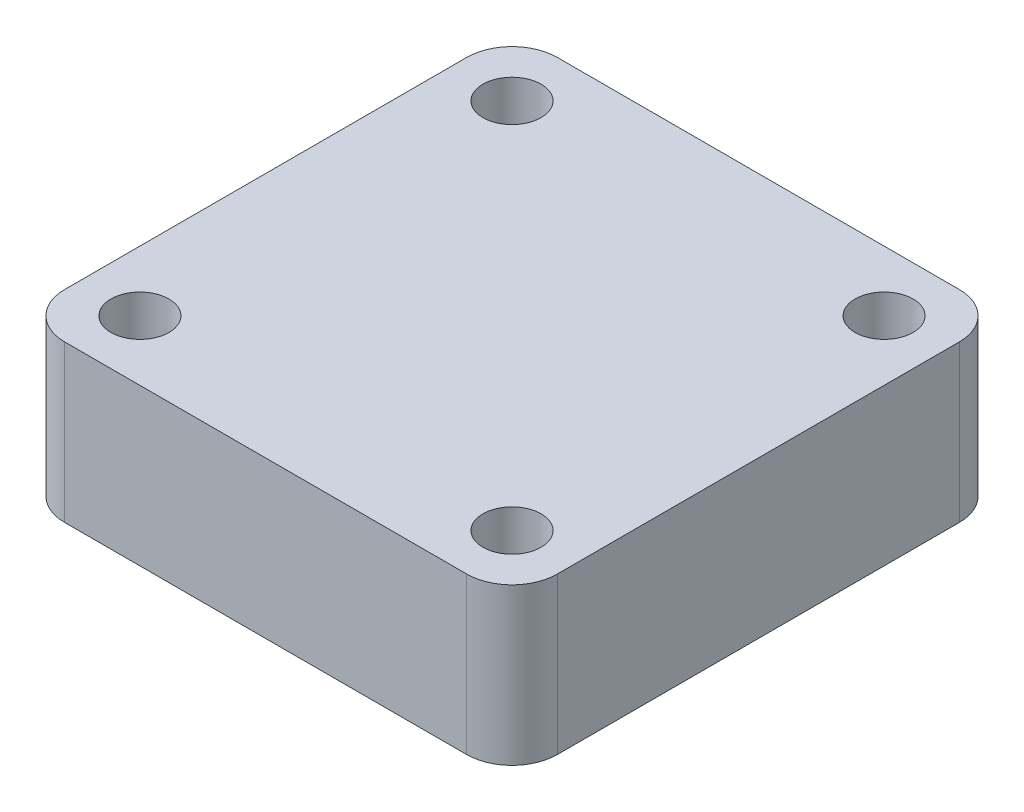
ISO-10303-21;
HEADER;
FILE_DESCRIPTION(('STEP AP214'),'2;1');
FILE_NAME('part.step','',(''),(''),'','','');
FILE_SCHEMA(('AUTOMOTIVE_DESIGN { 1 0 10303 214 1 1 1 1 }'));
ENDSEC;
DATA;
#1=APPLICATION_CONTEXT('core data for automotive mechanical design processes');
#2=APPLICATION_PROTOCOL_DEFINITION('international standard','automotive_design',2000,#1);
#3=PRODUCT_CONTEXT('',#1,'mechanical');
#4=PRODUCT('Part','Part','',(#3));
#5=PRODUCT_RELATED_PRODUCT_CATEGORY('part','',(#4));
#6=PRODUCT_DEFINITION_FORMATION('','',#4);
#7=PRODUCT_DEFINITION_CONTEXT('part definition',#1,'design');
#8=PRODUCT_DEFINITION('design','',#6,#7);
#9=PRODUCT_DEFINITION_SHAPE('','',#8);
#10=(LENGTH_UNIT() NAMED_UNIT(*) SI_UNIT(.MILLI.,.METRE.));
#11=(NAMED_UNIT(*) PLANE_ANGLE_UNIT() SI_UNIT($,.RADIAN.));
#12=(NAMED_UNIT(*) SI_UNIT($,.STERADIAN.) SOLID_ANGLE_UNIT());
#13=UNCERTAINTY_MEASURE_WITH_UNIT(LENGTH_MEASURE(1.E-05),#10,'distance_accuracy_value','');
#14=(GEOMETRIC_REPRESENTATION_CONTEXT(3) GLOBAL_UNCERTAINTY_ASSIGNED_CONTEXT((#13)) GLOBAL_UNIT_ASSIGNED_CONTEXT((#10,
#11,#12)) REPRESENTATION_CONTEXT('',''));
#15=CARTESIAN_POINT('',(0.,0.,0.));
#16=DIRECTION('',(0.,0.,1.));
#17=DIRECTION('',(1.,0.,0.));
#18=AXIS2_PLACEMENT_3D('',#15,#16,#17);
#19=CARTESIAN_POINT('',(27.57,17.5,27.57));
#20=DIRECTION('',(-1.,0.,0.));
#21=DIRECTION('',(0.,0.,1.));
#22=AXIS2_PLACEMENT_3D('',#19,#20,#21);
#23=PLANE('',#22);
#24=DIRECTION('',(0.,0.,-1.));
#25=VECTOR('',#24,1.);
#26=CARTESIAN_POINT('',(27.57,17.5,27.57));
#27=LINE('',#26,#25);
#28=CARTESIAN_POINT('',(27.57,17.5,22.49));
#29=VERTEX_POINT('',#28);
#30=CARTESIAN_POINT('',(27.57,17.5,-22.49));
#31=VERTEX_POINT('',#30);
#32=EDGE_CURVE('E126',#29,#31,#27,.T.);
#33=ORIENTED_EDGE('',*,*,#32,.F.);
#34=DIRECTION('',(0.,-1.,0.));
#35=VECTOR('',#34,1.);
#36=CARTESIAN_POINT('',(27.57,17.5,22.49));
#37=LINE('',#36,#35);
#38=CARTESIAN_POINT('',(27.57,0.,22.49));
#39=VERTEX_POINT('',#38);
#40=EDGE_CURVE('E11',#29,#39,#37,.T.);
#41=ORIENTED_EDGE('',*,*,#40,.T.);
#42=DIRECTION('',(0.,0.,-1.));
#43=VECTOR('',#42,1.);
#44=CARTESIAN_POINT('',(27.57,0.,27.57));
#45=LINE('',#44,#43);
#46=CARTESIAN_POINT('',(27.57,0.,-22.49));
#47=VERTEX_POINT('',#46);
#48=EDGE_CURVE('E128',#39,#47,#45,.T.);
#49=ORIENTED_EDGE('',*,*,#48,.T.);
#50=DIRECTION('',(0.,-1.,0.));
#51=VECTOR('',#50,1.);
#52=CARTESIAN_POINT('',(27.57,17.5,-22.49));
#53=LINE('',#52,#51);
#54=EDGE_CURVE('E145',#47,#31,#53,.F.);
#55=ORIENTED_EDGE('',*,*,#54,.T.);
#56=EDGE_LOOP('',(#33,#41,#49,#55));
#57=FACE_BOUND('',#56,.T.);
#58=ADVANCED_FACE('F34',(#57),#23,.F.);
#59=CARTESIAN_POINT('',(-27.57,17.5,-27.57));
#60=DIRECTION('',(0.,0.,1.));
#61=DIRECTION('',(1.,0.,0.));
#62=AXIS2_PLACEMENT_3D('',#59,#60,#61);
#63=PLANE('',#62);
#64=DIRECTION('',(-1.,0.,0.));
#65=VECTOR('',#64,1.);
#66=CARTESIAN_POINT('',(-27.57,17.5,-27.57));
#67=LINE('',#66,#65);
#68=CARTESIAN_POINT('',(22.49,17.5,-27.57));
#69=VERTEX_POINT('',#68);
#70=CARTESIAN_POINT('',(-22.49,17.5,-27.57));
#71=VERTEX_POINT('',#70);
#72=EDGE_CURVE('E209',#69,#71,#67,.T.);
#73=ORIENTED_EDGE('',*,*,#72,.F.);
#74=DIRECTION('',(0.,-1.,0.));
#75=VECTOR('',#74,1.);
#76=CARTESIAN_POINT('',(22.49,17.5,-27.57));
#77=LINE('',#76,#75);
#78=CARTESIAN_POINT('',(22.49,0.,-27.57));
#79=VERTEX_POINT('',#78);
#80=EDGE_CURVE('E139',#69,#79,#77,.T.);
#81=ORIENTED_EDGE('',*,*,#80,.T.);
#82=DIRECTION('',(-1.,0.,0.));
#83=VECTOR('',#82,1.);
#84=CARTESIAN_POINT('',(-27.57,0.,-27.57));
#85=LINE('',#84,#83);
#86=CARTESIAN_POINT('',(-22.49,0.,-27.57));
#87=VERTEX_POINT('',#86);
#88=EDGE_CURVE('E123',#79,#87,#85,.T.);
#89=ORIENTED_EDGE('',*,*,#88,.T.);
#90=DIRECTION('',(0.,-1.,0.));
#91=VECTOR('',#90,1.);
#92=CARTESIAN_POINT('',(-22.49,17.5,-27.57));
#93=LINE('',#92,#91);
#94=EDGE_CURVE('E109',#87,#71,#93,.F.);
#95=ORIENTED_EDGE('',*,*,#94,.T.);
#96=EDGE_LOOP('',(#73,#81,#89,#95));
#97=FACE_BOUND('',#96,.T.);
#98=ADVANCED_FACE('F181',(#97),#63,.F.);
#99=CARTESIAN_POINT('',(-27.57,17.5,27.57));
#100=DIRECTION('',(1.,0.,0.));
#101=DIRECTION('',(0.,0.,-1.));
#102=AXIS2_PLACEMENT_3D('',#99,#100,#101);
#103=PLANE('',#102);
#104=DIRECTION('',(0.,0.,1.));
#105=VECTOR('',#104,1.);
#106=CARTESIAN_POINT('',(-27.57,0.,27.57));
#107=LINE('',#106,#105);
#108=CARTESIAN_POINT('',(-27.57,0.,-22.49));
#109=VERTEX_POINT('',#108);
#110=CARTESIAN_POINT('',(-27.57,0.,22.49));
#111=VERTEX_POINT('',#110);
#112=EDGE_CURVE('E115',#109,#111,#107,.T.);
#113=ORIENTED_EDGE('',*,*,#112,.T.);
#114=DIRECTION('',(0.,-1.,0.));
#115=VECTOR('',#114,1.);
#116=CARTESIAN_POINT('',(-27.57,17.5,22.49));
#117=LINE('',#116,#115);
#118=CARTESIAN_POINT('',(-27.57,17.5,22.49));
#119=VERTEX_POINT('',#118);
#120=EDGE_CURVE('E57',#111,#119,#117,.F.);
#121=ORIENTED_EDGE('',*,*,#120,.T.);
#122=DIRECTION('',(0.,0.,1.));
#123=VECTOR('',#122,1.);
#124=CARTESIAN_POINT('',(-27.57,17.5,27.57));
#125=LINE('',#124,#123);
#126=CARTESIAN_POINT('',(-27.57,17.5,-22.49));
#127=VERTEX_POINT('',#126);
#128=EDGE_CURVE('E116',#127,#119,#125,.T.);
#129=ORIENTED_EDGE('',*,*,#128,.F.);
#130=DIRECTION('',(0.,-1.,0.));
#131=VECTOR('',#130,1.);
#132=CARTESIAN_POINT('',(-27.57,17.5,-22.49));
#133=LINE('',#132,#131);
#134=EDGE_CURVE('E107',#127,#109,#133,.T.);
#135=ORIENTED_EDGE('',*,*,#134,.T.);
#136=EDGE_LOOP('',(#113,#121,#129,#135));
#137=FACE_BOUND('',#136,.T.);
#138=ADVANCED_FACE('F114',(#137),#103,.F.);
#139=CARTESIAN_POINT('',(-27.57,17.5,27.57));
#140=DIRECTION('',(0.,0.,-1.));
#141=DIRECTION('',(-1.,0.,0.));
#142=AXIS2_PLACEMENT_3D('',#139,#140,#141);
#143=PLANE('',#142);
#144=DIRECTION('',(1.,0.,0.));
#145=VECTOR('',#144,1.);
#146=CARTESIAN_POINT('',(-27.57,17.5,27.57));
#147=LINE('',#146,#145);
#148=CARTESIAN_POINT('',(-22.49,17.5,27.57));
#149=VERTEX_POINT('',#148);
#150=CARTESIAN_POINT('',(22.49,17.5,27.57));
#151=VERTEX_POINT('',#150);
#152=EDGE_CURVE('E117',#149,#151,#147,.T.);
#153=ORIENTED_EDGE('',*,*,#152,.F.);
#154=DIRECTION('',(0.,-1.,0.));
#155=VECTOR('',#154,1.);
#156=CARTESIAN_POINT('',(-22.49,17.5,27.57));
#157=LINE('',#156,#155);
#158=CARTESIAN_POINT('',(-22.49,0.,27.57));
#159=VERTEX_POINT('',#158);
#160=EDGE_CURVE('E152',#149,#159,#157,.T.);
#161=ORIENTED_EDGE('',*,*,#160,.T.);
#162=DIRECTION('',(1.,0.,0.));
#163=VECTOR('',#162,1.);
#164=CARTESIAN_POINT('',(-27.57,0.,27.57));
#165=LINE('',#164,#163);
#166=CARTESIAN_POINT('',(22.49,0.,27.57));
#167=VERTEX_POINT('',#166);
#168=EDGE_CURVE('E122',#159,#167,#165,.T.);
#169=ORIENTED_EDGE('',*,*,#168,.T.);
#170=DIRECTION('',(0.,-1.,0.));
#171=VECTOR('',#170,1.);
#172=CARTESIAN_POINT('',(22.49,17.5,27.57));
#173=LINE('',#172,#171);
#174=EDGE_CURVE('E150',#167,#151,#173,.F.);
#175=ORIENTED_EDGE('',*,*,#174,.T.);
#176=EDGE_LOOP('',(#153,#161,#169,#175));
#177=FACE_BOUND('',#176,.T.);
#178=ADVANCED_FACE('F165',(#177),#143,.F.);
#179=CARTESIAN_POINT('',(0.,17.5,0.));
#180=DIRECTION('',(0.,-1.,0.));
#181=DIRECTION('',(0.,0.,-1.));
#182=AXIS2_PLACEMENT_3D('',#179,#180,#181);
#183=PLANE('',#182);
#184=CARTESIAN_POINT('',(20.82,17.5,20.82));
#185=DIRECTION('',(0.,1.,0.));
#186=DIRECTION('',(0.,0.,1.));
#187=AXIS2_PLACEMENT_3D('',#184,#185,#186);
#188=CIRCLE('',#187,3.25);
#189=CARTESIAN_POINT('',(20.82,17.5,24.07));
#190=VERTEX_POINT('',#189);
#191=EDGE_CURVE('E231',#190,#190,#188,.T.);
#192=ORIENTED_EDGE('',*,*,#191,.F.);
#193=EDGE_LOOP('',(#192));
#194=FACE_BOUND('',#193,.T.);
#195=CARTESIAN_POINT('',(-20.82,17.5,20.82));
#196=DIRECTION('',(0.,-1.,0.));
#197=DIRECTION('',(0.,0.,-1.));
#198=AXIS2_PLACEMENT_3D('',#195,#196,#197);
#199=CIRCLE('',#198,3.25);
#200=CARTESIAN_POINT('',(-20.82,17.5,17.57));
#201=VERTEX_POINT('',#200);
#202=EDGE_CURVE('E224',#201,#201,#199,.T.);
#203=ORIENTED_EDGE('',*,*,#202,.T.);
#204=EDGE_LOOP('',(#203));
#205=FACE_BOUND('',#204,.T.);
#206=CARTESIAN_POINT('',(20.82,17.5,-20.82));
#207=DIRECTION('',(0.,-1.,0.));
#208=DIRECTION('',(0.,0.,-1.));
#209=AXIS2_PLACEMENT_3D('',#206,#207,#208);
#210=CIRCLE('',#209,3.25);
#211=CARTESIAN_POINT('',(20.82,17.5,-24.07));
#212=VERTEX_POINT('',#211);
#213=EDGE_CURVE('E218',#212,#212,#210,.T.);
#214=ORIENTED_EDGE('',*,*,#213,.T.);
#215=EDGE_LOOP('',(#214));
#216=FACE_BOUND('',#215,.T.);
#217=CARTESIAN_POINT('',(-20.82,17.5,-20.82));
#218=DIRECTION('',(0.,1.,0.));
#219=DIRECTION('',(0.,0.,1.));
#220=AXIS2_PLACEMENT_3D('',#217,#218,#219);
#221=CIRCLE('',#220,3.25);
#222=CARTESIAN_POINT('',(-20.82,17.5,-17.57));
#223=VERTEX_POINT('',#222);
#224=EDGE_CURVE('E134',#223,#223,#221,.T.);
#225=ORIENTED_EDGE('',*,*,#224,.F.);
#226=EDGE_LOOP('',(#225));
#227=FACE_BOUND('',#226,.T.);
#228=ORIENTED_EDGE('',*,*,#128,.T.);
#229=CARTESIAN_POINT('',(-22.49,17.5,22.49));
#230=DIRECTION('',(0.,-1.,0.));
#231=DIRECTION('',(0.,0.,-1.));
#232=AXIS2_PLACEMENT_3D('',#229,#230,#231);
#233=CIRCLE('',#232,5.08);
#234=EDGE_CURVE('E42',#119,#149,#233,.F.);
#235=ORIENTED_EDGE('',*,*,#234,.T.);
#236=ORIENTED_EDGE('',*,*,#152,.T.);
#237=CARTESIAN_POINT('',(22.49,17.5,22.49));
#238=DIRECTION('',(0.,-1.,0.));
#239=DIRECTION('',(0.,0.,-1.));
#240=AXIS2_PLACEMENT_3D('',#237,#238,#239);
#241=CIRCLE('',#240,5.08);
#242=EDGE_CURVE('E49',#151,#29,#241,.F.);
#243=ORIENTED_EDGE('',*,*,#242,.T.);
#244=ORIENTED_EDGE('',*,*,#32,.T.);
#245=CARTESIAN_POINT('',(22.49,17.5,-22.49));
#246=DIRECTION('',(0.,-1.,0.));
#247=DIRECTION('',(0.,0.,-1.));
#248=AXIS2_PLACEMENT_3D('',#245,#246,#247);
#249=CIRCLE('',#248,5.08);
#250=EDGE_CURVE('E148',#31,#69,#249,.F.);
#251=ORIENTED_EDGE('',*,*,#250,.T.);
#252=ORIENTED_EDGE('',*,*,#72,.T.);
#253=CARTESIAN_POINT('',(-22.49,17.5,-22.49));
#254=DIRECTION('',(0.,-1.,0.));
#255=DIRECTION('',(0.,0.,-1.));
#256=AXIS2_PLACEMENT_3D('',#253,#254,#255);
#257=CIRCLE('',#256,5.08);
#258=EDGE_CURVE('E137',#71,#127,#257,.F.);
#259=ORIENTED_EDGE('',*,*,#258,.T.);
#260=EDGE_LOOP('',(#228,#235,#236,#243,#244,#251,#252,#259));
#261=FACE_BOUND('',#260,.T.);
#262=ADVANCED_FACE('F161',(#194,#205,#216,#227,#261),#183,.F.);
#263=CARTESIAN_POINT('',(0.,0.,0.));
#264=DIRECTION('',(0.,-1.,0.));
#265=DIRECTION('',(0.,0.,-1.));
#266=AXIS2_PLACEMENT_3D('',#263,#264,#265);
#267=PLANE('',#266);
#268=CARTESIAN_POINT('',(20.82,0.,20.82));
#269=DIRECTION('',(0.,1.,0.));
#270=DIRECTION('',(0.,0.,1.));
#271=AXIS2_PLACEMENT_3D('',#268,#269,#270);
#272=CIRCLE('',#271,3.25);
#273=CARTESIAN_POINT('',(20.82,0.,24.07));
#274=VERTEX_POINT('',#273);
#275=EDGE_CURVE('E230',#274,#274,#272,.T.);
#276=ORIENTED_EDGE('',*,*,#275,.T.);
#277=EDGE_LOOP('',(#276));
#278=FACE_BOUND('',#277,.T.);
#279=CARTESIAN_POINT('',(-20.82,0.,20.82));
#280=DIRECTION('',(0.,1.,0.));
#281=DIRECTION('',(0.,0.,1.));
#282=AXIS2_PLACEMENT_3D('',#279,#280,#281);
#283=CIRCLE('',#282,3.25);
#284=CARTESIAN_POINT('',(-20.82,0.,24.07));
#285=VERTEX_POINT('',#284);
#286=EDGE_CURVE('E227',#285,#285,#283,.T.);
#287=ORIENTED_EDGE('',*,*,#286,.T.);
#288=EDGE_LOOP('',(#287));
#289=FACE_BOUND('',#288,.T.);
#290=CARTESIAN_POINT('',(20.82,0.,-20.82));
#291=DIRECTION('',(0.,1.,0.));
#292=DIRECTION('',(0.,0.,1.));
#293=AXIS2_PLACEMENT_3D('',#290,#291,#292);
#294=CIRCLE('',#293,3.25);
#295=CARTESIAN_POINT('',(20.82,0.,-17.57));
#296=VERTEX_POINT('',#295);
#297=EDGE_CURVE('E221',#296,#296,#294,.T.);
#298=ORIENTED_EDGE('',*,*,#297,.T.);
#299=EDGE_LOOP('',(#298));
#300=FACE_BOUND('',#299,.T.);
#301=CARTESIAN_POINT('',(-20.82,0.,-20.82));
#302=DIRECTION('',(0.,-1.,0.));
#303=DIRECTION('',(0.,0.,-1.));
#304=AXIS2_PLACEMENT_3D('',#301,#302,#303);
#305=CIRCLE('',#304,3.25);
#306=CARTESIAN_POINT('',(-20.82,0.,-24.07));
#307=VERTEX_POINT('',#306);
#308=EDGE_CURVE('E132',#307,#307,#305,.T.);
#309=ORIENTED_EDGE('',*,*,#308,.F.);
#310=EDGE_LOOP('',(#309));
#311=FACE_BOUND('',#310,.T.);
#312=ORIENTED_EDGE('',*,*,#168,.F.);
#313=CARTESIAN_POINT('',(-22.49,0.,22.49));
#314=DIRECTION('',(0.,-1.,0.));
#315=DIRECTION('',(0.,0.,-1.));
#316=AXIS2_PLACEMENT_3D('',#313,#314,#315);
#317=CIRCLE('',#316,5.08);
#318=EDGE_CURVE('E121',#159,#111,#317,.T.);
#319=ORIENTED_EDGE('',*,*,#318,.T.);
#320=ORIENTED_EDGE('',*,*,#112,.F.);
#321=CARTESIAN_POINT('',(-22.49,0.,-22.49));
#322=DIRECTION('',(0.,-1.,0.));
#323=DIRECTION('',(0.,0.,-1.));
#324=AXIS2_PLACEMENT_3D('',#321,#322,#323);
#325=CIRCLE('',#324,5.08);
#326=EDGE_CURVE('E103',#109,#87,#325,.T.);
#327=ORIENTED_EDGE('',*,*,#326,.T.);
#328=ORIENTED_EDGE('',*,*,#88,.F.);
#329=CARTESIAN_POINT('',(22.49,0.,-22.49));
#330=DIRECTION('',(0.,-1.,0.));
#331=DIRECTION('',(0.,0.,-1.));
#332=AXIS2_PLACEMENT_3D('',#329,#330,#331);
#333=CIRCLE('',#332,5.08);
#334=EDGE_CURVE('E142',#79,#47,#333,.T.);
#335=ORIENTED_EDGE('',*,*,#334,.T.);
#336=ORIENTED_EDGE('',*,*,#48,.F.);
#337=CARTESIAN_POINT('',(22.49,0.,22.49));
#338=DIRECTION('',(0.,-1.,0.));
#339=DIRECTION('',(0.,0.,-1.));
#340=AXIS2_PLACEMENT_3D('',#337,#338,#339);
#341=CIRCLE('',#340,5.08);
#342=EDGE_CURVE('E155',#39,#167,#341,.T.);
#343=ORIENTED_EDGE('',*,*,#342,.T.);
#344=EDGE_LOOP('',(#312,#319,#320,#327,#328,#335,#336,#343));
#345=FACE_BOUND('',#344,.T.);
#346=ADVANCED_FACE('F120',(#278,#289,#300,#311,#345),#267,.T.);
#347=CARTESIAN_POINT('',(-20.82,-33.3,-20.82));
#348=DIRECTION('',(0.,1.,0.));
#349=DIRECTION('',(0.,0.,1.));
#350=AXIS2_PLACEMENT_3D('',#347,#348,#349);
#351=CYLINDRICAL_SURFACE('',#350,3.25);
#352=ORIENTED_EDGE('',*,*,#308,.T.);
#353=EDGE_LOOP('',(#352));
#354=FACE_BOUND('',#353,.T.);
#355=ORIENTED_EDGE('',*,*,#224,.T.);
#356=EDGE_LOOP('',(#355));
#357=FACE_BOUND('',#356,.T.);
#358=ADVANCED_FACE('F193',(#354,#357),#351,.F.);
#359=CARTESIAN_POINT('',(-22.49,17.5,-22.49));
#360=DIRECTION('',(0.,-1.,0.));
#361=DIRECTION('',(0.,0.,-1.));
#362=AXIS2_PLACEMENT_3D('',#359,#360,#361);
#363=CYLINDRICAL_SURFACE('',#362,5.08);
#364=ORIENTED_EDGE('',*,*,#258,.F.);
#365=ORIENTED_EDGE('',*,*,#94,.F.);
#366=ORIENTED_EDGE('',*,*,#326,.F.);
#367=ORIENTED_EDGE('',*,*,#134,.F.);
#368=EDGE_LOOP('',(#364,#365,#366,#367));
#369=FACE_BOUND('',#368,.T.);
#370=ADVANCED_FACE('F106',(#369),#363,.T.);
#371=CARTESIAN_POINT('',(20.82,0.,-20.82));
#372=DIRECTION('',(0.,1.,0.));
#373=DIRECTION('',(0.,0.,1.));
#374=AXIS2_PLACEMENT_3D('',#371,#372,#373);
#375=CYLINDRICAL_SURFACE('',#374,3.25);
#376=ORIENTED_EDGE('',*,*,#297,.F.);
#377=EDGE_LOOP('',(#376));
#378=FACE_BOUND('',#377,.T.);
#379=ORIENTED_EDGE('',*,*,#213,.F.);
#380=EDGE_LOOP('',(#379));
#381=FACE_BOUND('',#380,.T.);
#382=ADVANCED_FACE('F192',(#378,#381),#375,.F.);
#383=CARTESIAN_POINT('',(22.49,17.5,-22.49));
#384=DIRECTION('',(0.,-1.,0.));
#385=DIRECTION('',(0.,0.,-1.));
#386=AXIS2_PLACEMENT_3D('',#383,#384,#385);
#387=CYLINDRICAL_SURFACE('',#386,5.08);
#388=ORIENTED_EDGE('',*,*,#250,.F.);
#389=ORIENTED_EDGE('',*,*,#54,.F.);
#390=ORIENTED_EDGE('',*,*,#334,.F.);
#391=ORIENTED_EDGE('',*,*,#80,.F.);
#392=EDGE_LOOP('',(#388,#389,#390,#391));
#393=FACE_BOUND('',#392,.T.);
#394=ADVANCED_FACE('F194',(#393),#387,.T.);
#395=CARTESIAN_POINT('',(-20.82,0.,20.82));
#396=DIRECTION('',(0.,1.,0.));
#397=DIRECTION('',(0.,0.,1.));
#398=AXIS2_PLACEMENT_3D('',#395,#396,#397);
#399=CYLINDRICAL_SURFACE('',#398,3.25);
#400=ORIENTED_EDGE('',*,*,#286,.F.);
#401=EDGE_LOOP('',(#400));
#402=FACE_BOUND('',#401,.T.);
#403=ORIENTED_EDGE('',*,*,#202,.F.);
#404=EDGE_LOOP('',(#403));
#405=FACE_BOUND('',#404,.T.);
#406=ADVANCED_FACE('F176',(#402,#405),#399,.F.);
#407=CARTESIAN_POINT('',(20.82,0.,20.82));
#408=DIRECTION('',(0.,1.,0.));
#409=DIRECTION('',(0.,0.,1.));
#410=AXIS2_PLACEMENT_3D('',#407,#408,#409);
#411=CYLINDRICAL_SURFACE('',#410,3.25);
#412=ORIENTED_EDGE('',*,*,#275,.F.);
#413=EDGE_LOOP('',(#412));
#414=FACE_BOUND('',#413,.T.);
#415=ORIENTED_EDGE('',*,*,#191,.T.);
#416=EDGE_LOOP('',(#415));
#417=FACE_BOUND('',#416,.T.);
#418=ADVANCED_FACE('F170',(#414,#417),#411,.F.);
#419=CARTESIAN_POINT('',(-22.49,17.5,22.49));
#420=DIRECTION('',(0.,-1.,0.));
#421=DIRECTION('',(0.,0.,-1.));
#422=AXIS2_PLACEMENT_3D('',#419,#420,#421);
#423=CYLINDRICAL_SURFACE('',#422,5.08);
#424=ORIENTED_EDGE('',*,*,#234,.F.);
#425=ORIENTED_EDGE('',*,*,#120,.F.);
#426=ORIENTED_EDGE('',*,*,#318,.F.);
#427=ORIENTED_EDGE('',*,*,#160,.F.);
#428=EDGE_LOOP('',(#424,#425,#426,#427));
#429=FACE_BOUND('',#428,.T.);
#430=ADVANCED_FACE('F168',(#429),#423,.T.);
#431=CARTESIAN_POINT('',(22.49,17.5,22.49));
#432=DIRECTION('',(0.,-1.,0.));
#433=DIRECTION('',(0.,0.,-1.));
#434=AXIS2_PLACEMENT_3D('',#431,#432,#433);
#435=CYLINDRICAL_SURFACE('',#434,5.08);
#436=ORIENTED_EDGE('',*,*,#242,.F.);
#437=ORIENTED_EDGE('',*,*,#174,.F.);
#438=ORIENTED_EDGE('',*,*,#342,.F.);
#439=ORIENTED_EDGE('',*,*,#40,.F.);
#440=EDGE_LOOP('',(#436,#437,#438,#439));
#441=FACE_BOUND('',#440,.T.);
#442=ADVANCED_FACE('F36',(#441),#435,.T.);
#443=CLOSED_SHELL('',(#58,#98,#138,#178,#262,#346,#358,#370,#382,#394,#406,#418,#430,#442));
#444=MANIFOLD_SOLID_BREP('B2',#443);
#445=ADVANCED_BREP_SHAPE_REPRESENTATION('',(#18,#444),#14);
#446=SHAPE_DEFINITION_REPRESENTATION(#9,#445);
ENDSEC;
END-ISO-10303-21;
